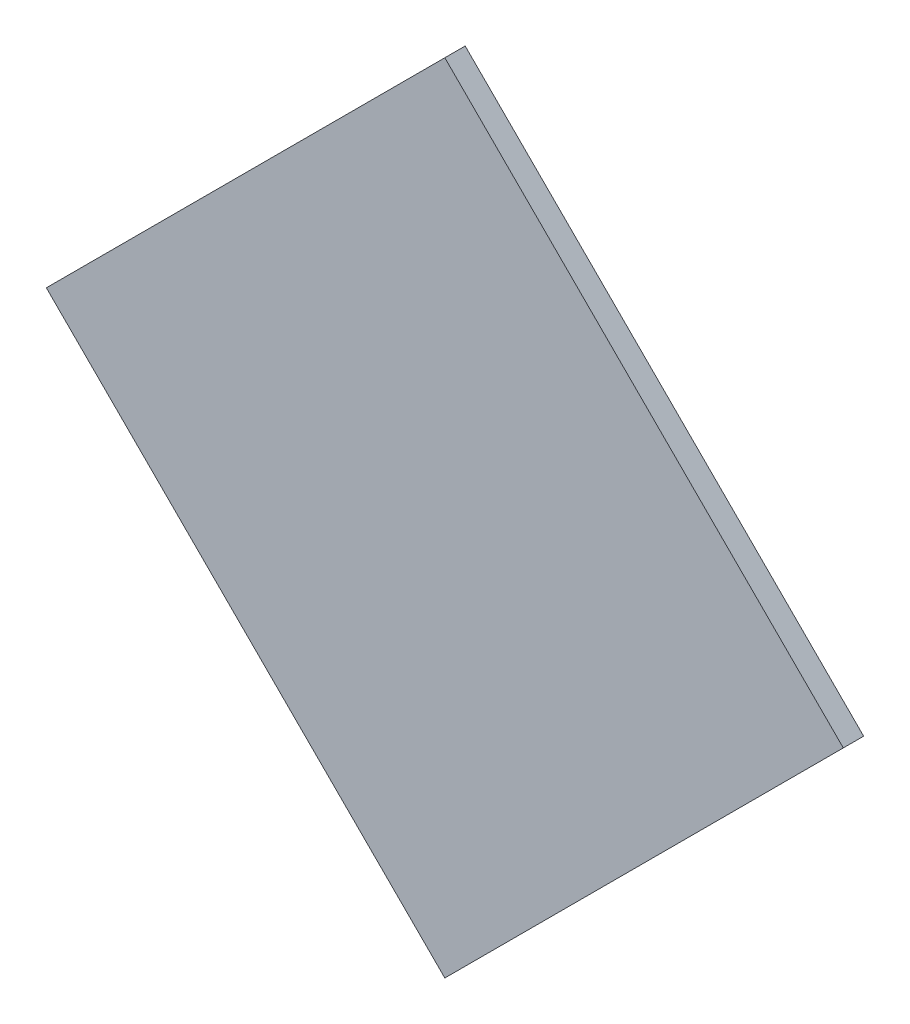
ISO-10303-21;
HEADER;
FILE_DESCRIPTION(('STEP AP214'),'2;1');
FILE_NAME('part.step','',(''),(''),'','','');
FILE_SCHEMA(('AUTOMOTIVE_DESIGN { 1 0 10303 214 1 1 1 1 }'));
ENDSEC;
DATA;
#1=APPLICATION_CONTEXT('core data for automotive mechanical design processes');
#2=APPLICATION_PROTOCOL_DEFINITION('international standard','automotive_design',2000,#1);
#3=PRODUCT_CONTEXT('',#1,'mechanical');
#4=PRODUCT('Part','Part','',(#3));
#5=PRODUCT_RELATED_PRODUCT_CATEGORY('part','',(#4));
#6=PRODUCT_DEFINITION_FORMATION('','',#4);
#7=PRODUCT_DEFINITION_CONTEXT('part definition',#1,'design');
#8=PRODUCT_DEFINITION('design','',#6,#7);
#9=PRODUCT_DEFINITION_SHAPE('','',#8);
#10=(LENGTH_UNIT() NAMED_UNIT(*) SI_UNIT(.MILLI.,.METRE.));
#11=(NAMED_UNIT(*) PLANE_ANGLE_UNIT() SI_UNIT($,.RADIAN.));
#12=(NAMED_UNIT(*) SI_UNIT($,.STERADIAN.) SOLID_ANGLE_UNIT());
#13=UNCERTAINTY_MEASURE_WITH_UNIT(LENGTH_MEASURE(1.E-05),#10,'distance_accuracy_value','');
#14=(GEOMETRIC_REPRESENTATION_CONTEXT(3) GLOBAL_UNCERTAINTY_ASSIGNED_CONTEXT((#13)) GLOBAL_UNIT_ASSIGNED_CONTEXT((#10,
#11,#12)) REPRESENTATION_CONTEXT('',''));
#15=CARTESIAN_POINT('',(0.,0.,0.));
#16=DIRECTION('',(0.,0.,1.));
#17=DIRECTION('',(1.,0.,0.));
#18=AXIS2_PLACEMENT_3D('',#15,#16,#17);
#19=CARTESIAN_POINT('',(5.28167,7.006213583125,0.79916));
#20=DIRECTION('',(0.,0.,1.));
#21=DIRECTION('',(0.,-1.,0.));
#22=AXIS2_PLACEMENT_3D('',#19,#20,#21);
#23=PLANE('',#22);
#24=DIRECTION('',(0.70710643013396,0.70710713223896,0.));
#25=VECTOR('',#24,1.);
#26=CARTESIAN_POINT('',(4.609918667,7.006213333,0.79916));
#27=LINE('',#26,#25);
#28=CARTESIAN_POINT('',(5.28167000000001,7.67796533299999,0.79916));
#29=VERTEX_POINT('',#28);
#30=CARTESIAN_POINT('',(4.609918667,7.006213333,0.79916));
#31=VERTEX_POINT('',#30);
#32=EDGE_CURVE('E68',#29,#31,#27,.F.);
#33=ORIENTED_EDGE('',*,*,#32,.T.);
#34=DIRECTION('',(-0.707106781186548,0.707106781186548,0.));
#35=VECTOR('',#34,1.);
#36=CARTESIAN_POINT('',(5.28167,6.334462,0.79916));
#37=LINE('',#36,#35);
#38=CARTESIAN_POINT('',(5.28167,6.334462,0.79916));
#39=VERTEX_POINT('',#38);
#40=EDGE_CURVE('E55',#31,#39,#37,.F.);
#41=ORIENTED_EDGE('',*,*,#40,.T.);
#42=DIRECTION('',(-0.707106781186548,-0.707106781186548,0.));
#43=VECTOR('',#42,1.);
#44=CARTESIAN_POINT('',(5.953421333,7.006213333,0.79916));
#45=LINE('',#44,#43);
#46=CARTESIAN_POINT('',(5.953421333,7.006213333,0.79916));
#47=VERTEX_POINT('',#46);
#48=EDGE_CURVE('E20',#39,#47,#45,.F.);
#49=ORIENTED_EDGE('',*,*,#48,.T.);
#50=DIRECTION('',(0.70710643013396,-0.70710713223896,0.));
#51=VECTOR('',#50,1.);
#52=CARTESIAN_POINT('',(5.28167,7.677965333,0.79916));
#53=LINE('',#52,#51);
#54=EDGE_CURVE('E81',#47,#29,#53,.F.);
#55=ORIENTED_EDGE('',*,*,#54,.T.);
#56=EDGE_LOOP('',(#33,#41,#49,#55));
#57=FACE_BOUND('',#56,.T.);
#58=ADVANCED_FACE('F17',(#57),#23,.T.);
#59=CARTESIAN_POINT('',(5.953421333,7.006213333,0.76487));
#60=DIRECTION('',(-0.707106781186548,0.707106781186548,0.));
#61=DIRECTION('',(-0.707106781186548,-0.707106781186548,0.));
#62=AXIS2_PLACEMENT_3D('',#59,#60,#61);
#63=PLANE('',#62);
#64=DIRECTION('',(0.,0.,1.));
#65=VECTOR('',#64,1.);
#66=CARTESIAN_POINT('',(5.28167,6.334462,0.76487));
#67=LINE('',#66,#65);
#68=CARTESIAN_POINT('',(5.28167,6.334462,0.76487));
#69=VERTEX_POINT('',#68);
#70=EDGE_CURVE('E61',#39,#69,#67,.F.);
#71=ORIENTED_EDGE('',*,*,#70,.T.);
#72=DIRECTION('',(-0.707106781186548,-0.707106781186548,0.));
#73=VECTOR('',#72,1.);
#74=CARTESIAN_POINT('',(5.953421333,7.006213333,0.76487));
#75=LINE('',#74,#73);
#76=CARTESIAN_POINT('',(5.953421333,7.006213333,0.76487));
#77=VERTEX_POINT('',#76);
#78=EDGE_CURVE('E83',#77,#69,#75,.T.);
#79=ORIENTED_EDGE('',*,*,#78,.F.);
#80=DIRECTION('',(0.,0.,1.));
#81=VECTOR('',#80,1.);
#82=CARTESIAN_POINT('',(5.95342133300001,7.00621333300001,0.76487));
#83=LINE('',#82,#81);
#84=EDGE_CURVE('E64',#77,#47,#83,.T.);
#85=ORIENTED_EDGE('',*,*,#84,.T.);
#86=ORIENTED_EDGE('',*,*,#48,.F.);
#87=EDGE_LOOP('',(#71,#79,#85,#86));
#88=FACE_BOUND('',#87,.T.);
#89=ADVANCED_FACE('F60',(#88),#63,.F.);
#90=CARTESIAN_POINT('',(5.28167,6.334462,0.76487));
#91=DIRECTION('',(0.707106781186548,0.707106781186548,0.));
#92=DIRECTION('',(-0.707106781186548,0.707106781186548,0.));
#93=AXIS2_PLACEMENT_3D('',#90,#91,#92);
#94=PLANE('',#93);
#95=DIRECTION('',(0.,0.,1.));
#96=VECTOR('',#95,1.);
#97=CARTESIAN_POINT('',(4.609918667,7.006213333,0.76487));
#98=LINE('',#97,#96);
#99=CARTESIAN_POINT('',(4.609918667,7.006213333,0.76487));
#100=VERTEX_POINT('',#99);
#101=EDGE_CURVE('E70',#31,#100,#98,.F.);
#102=ORIENTED_EDGE('',*,*,#101,.T.);
#103=DIRECTION('',(-0.707106781186549,0.707106781186547,0.));
#104=VECTOR('',#103,1.);
#105=CARTESIAN_POINT('',(5.28167,6.334462,0.76487));
#106=LINE('',#105,#104);
#107=EDGE_CURVE('E74',#69,#100,#106,.T.);
#108=ORIENTED_EDGE('',*,*,#107,.F.);
#109=ORIENTED_EDGE('',*,*,#70,.F.);
#110=ORIENTED_EDGE('',*,*,#40,.F.);
#111=EDGE_LOOP('',(#102,#108,#109,#110));
#112=FACE_BOUND('',#111,.T.);
#113=ADVANCED_FACE('F72',(#112),#94,.F.);
#114=CARTESIAN_POINT('',(4.609918667,7.006213333,0.76487));
#115=DIRECTION('',(0.70710713223896,-0.70710643013396,0.));
#116=DIRECTION('',(0.70710643013396,0.70710713223896,0.));
#117=AXIS2_PLACEMENT_3D('',#114,#115,#116);
#118=PLANE('',#117);
#119=DIRECTION('',(0.,0.,1.));
#120=VECTOR('',#119,1.);
#121=CARTESIAN_POINT('',(5.28167,7.677965333,0.76487));
#122=LINE('',#121,#120);
#123=CARTESIAN_POINT('',(5.28167000000001,7.67796533299999,0.76487));
#124=VERTEX_POINT('',#123);
#125=EDGE_CURVE('E35',#29,#124,#122,.F.);
#126=ORIENTED_EDGE('',*,*,#125,.T.);
#127=DIRECTION('',(0.707106430133946,0.707107132238975,0.));
#128=VECTOR('',#127,1.);
#129=CARTESIAN_POINT('',(4.609918667,7.006213333,0.76487));
#130=LINE('',#129,#128);
#131=EDGE_CURVE('E26',#100,#124,#130,.T.);
#132=ORIENTED_EDGE('',*,*,#131,.F.);
#133=ORIENTED_EDGE('',*,*,#101,.F.);
#134=ORIENTED_EDGE('',*,*,#32,.F.);
#135=EDGE_LOOP('',(#126,#132,#133,#134));
#136=FACE_BOUND('',#135,.T.);
#137=ADVANCED_FACE('F89',(#136),#118,.F.);
#138=CARTESIAN_POINT('',(5.28167,7.677965333,0.76487));
#139=DIRECTION('',(-0.70710713223896,-0.70710643013396,0.));
#140=DIRECTION('',(0.70710643013396,-0.70710713223896,0.));
#141=AXIS2_PLACEMENT_3D('',#138,#139,#140);
#142=PLANE('',#141);
#143=ORIENTED_EDGE('',*,*,#84,.F.);
#144=DIRECTION('',(0.707106430133945,-0.707107132238976,0.));
#145=VECTOR('',#144,1.);
#146=CARTESIAN_POINT('',(5.28167,7.677965333,0.76487));
#147=LINE('',#146,#145);
#148=EDGE_CURVE('E11',#124,#77,#147,.T.);
#149=ORIENTED_EDGE('',*,*,#148,.F.);
#150=ORIENTED_EDGE('',*,*,#125,.F.);
#151=ORIENTED_EDGE('',*,*,#54,.F.);
#152=EDGE_LOOP('',(#143,#149,#150,#151));
#153=FACE_BOUND('',#152,.T.);
#154=ADVANCED_FACE('F91',(#153),#142,.F.);
#155=CARTESIAN_POINT('',(5.28167,7.006213583125,0.76487));
#156=DIRECTION('',(0.,0.,-1.));
#157=DIRECTION('',(0.,1.,0.));
#158=AXIS2_PLACEMENT_3D('',#155,#156,#157);
#159=PLANE('',#158);
#160=ORIENTED_EDGE('',*,*,#131,.T.);
#161=ORIENTED_EDGE('',*,*,#148,.T.);
#162=ORIENTED_EDGE('',*,*,#78,.T.);
#163=ORIENTED_EDGE('',*,*,#107,.T.);
#164=EDGE_LOOP('',(#160,#161,#162,#163));
#165=FACE_BOUND('',#164,.T.);
#166=ADVANCED_FACE('F88',(#165),#159,.T.);
#167=CLOSED_SHELL('',(#58,#89,#113,#137,#154,#166));
#168=MANIFOLD_SOLID_BREP('B1',#167);
#169=ADVANCED_BREP_SHAPE_REPRESENTATION('',(#18,#168),#14);
#170=SHAPE_DEFINITION_REPRESENTATION(#9,#169);
ENDSEC;
END-ISO-10303-21;
